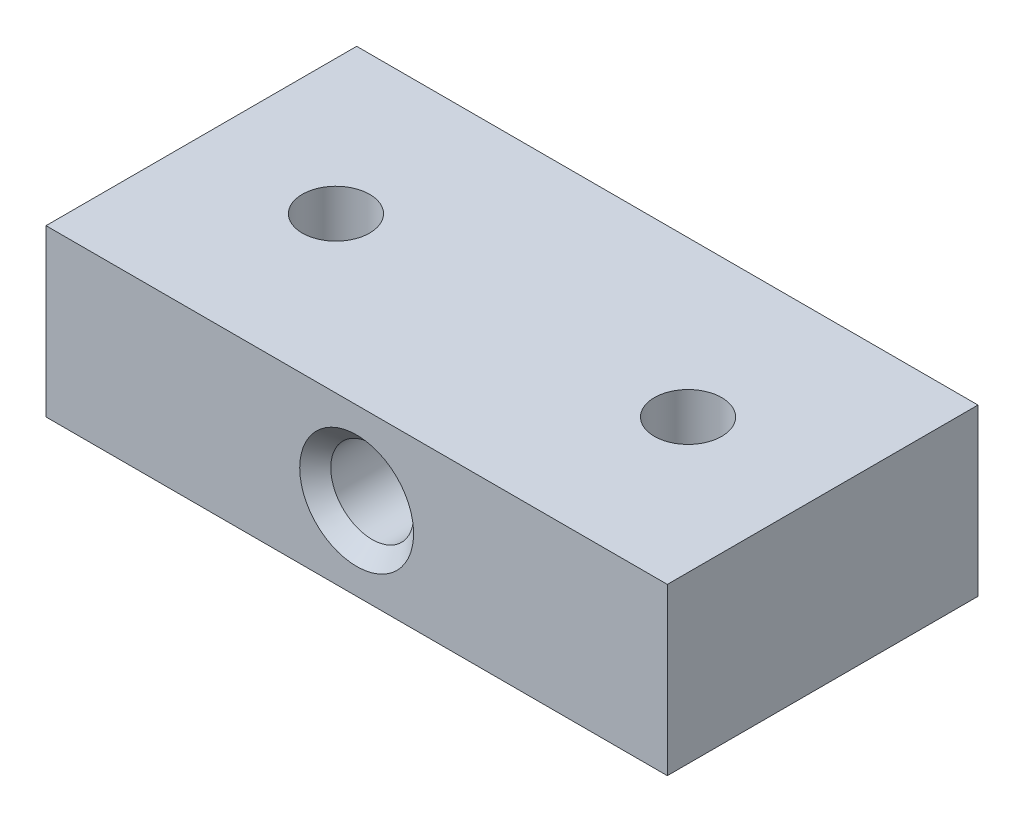
ISO-10303-21;
HEADER;
FILE_DESCRIPTION(('STEP AP214'),'2;1');
FILE_NAME('part.step','',(''),(''),'','','');
FILE_SCHEMA(('AUTOMOTIVE_DESIGN { 1 0 10303 214 1 1 1 1 }'));
ENDSEC;
DATA;
#1=APPLICATION_CONTEXT('core data for automotive mechanical design processes');
#2=APPLICATION_PROTOCOL_DEFINITION('international standard','automotive_design',2000,#1);
#3=PRODUCT_CONTEXT('',#1,'mechanical');
#4=PRODUCT('Part','Part','',(#3));
#5=PRODUCT_RELATED_PRODUCT_CATEGORY('part','',(#4));
#6=PRODUCT_DEFINITION_FORMATION('','',#4);
#7=PRODUCT_DEFINITION_CONTEXT('part definition',#1,'design');
#8=PRODUCT_DEFINITION('design','',#6,#7);
#9=PRODUCT_DEFINITION_SHAPE('','',#8);
#10=(LENGTH_UNIT() NAMED_UNIT(*) SI_UNIT(.MILLI.,.METRE.));
#11=(NAMED_UNIT(*) PLANE_ANGLE_UNIT() SI_UNIT($,.RADIAN.));
#12=(NAMED_UNIT(*) SI_UNIT($,.STERADIAN.) SOLID_ANGLE_UNIT());
#13=UNCERTAINTY_MEASURE_WITH_UNIT(LENGTH_MEASURE(1.E-05),#10,'distance_accuracy_value','');
#14=(GEOMETRIC_REPRESENTATION_CONTEXT(3) GLOBAL_UNCERTAINTY_ASSIGNED_CONTEXT((#13)) GLOBAL_UNIT_ASSIGNED_CONTEXT((#10,
#11,#12)) REPRESENTATION_CONTEXT('',''));
#15=CARTESIAN_POINT('',(0.,0.,0.));
#16=DIRECTION('',(0.,0.,1.));
#17=DIRECTION('',(1.,0.,0.));
#18=AXIS2_PLACEMENT_3D('',#15,#16,#17);
#19=CARTESIAN_POINT('',(0.,16.,0.));
#20=DIRECTION('',(0.,-1.,0.));
#21=DIRECTION('',(0.,0.,-1.));
#22=AXIS2_PLACEMENT_3D('',#19,#20,#21);
#23=PLANE('',#22);
#24=CARTESIAN_POINT('',(13.,16.,-15.));
#25=DIRECTION('',(0.,1.,0.));
#26=DIRECTION('',(0.,0.,1.));
#27=AXIS2_PLACEMENT_3D('',#24,#25,#26);
#28=CIRCLE('',#27,3.25);
#29=CARTESIAN_POINT('',(13.,16.,-11.75));
#30=VERTEX_POINT('',#29);
#31=EDGE_CURVE('E106',#30,#30,#28,.T.);
#32=ORIENTED_EDGE('',*,*,#31,.F.);
#33=EDGE_LOOP('',(#32));
#34=FACE_BOUND('',#33,.T.);
#35=DIRECTION('',(0.,0.,1.));
#36=VECTOR('',#35,1.);
#37=CARTESIAN_POINT('',(0.,16.,0.));
#38=LINE('',#37,#36);
#39=CARTESIAN_POINT('',(0.,16.,-30.));
#40=VERTEX_POINT('',#39);
#41=CARTESIAN_POINT('',(0.,16.,0.));
#42=VERTEX_POINT('',#41);
#43=EDGE_CURVE('E88',#40,#42,#38,.T.);
#44=ORIENTED_EDGE('',*,*,#43,.T.);
#45=DIRECTION('',(1.,0.,0.));
#46=VECTOR('',#45,1.);
#47=CARTESIAN_POINT('',(0.,16.,0.));
#48=LINE('',#47,#46);
#49=CARTESIAN_POINT('',(60.,16.,0.));
#50=VERTEX_POINT('',#49);
#51=EDGE_CURVE('E83',#42,#50,#48,.T.);
#52=ORIENTED_EDGE('',*,*,#51,.T.);
#53=DIRECTION('',(0.,0.,-1.));
#54=VECTOR('',#53,1.);
#55=CARTESIAN_POINT('',(60.,16.,0.));
#56=LINE('',#55,#54);
#57=CARTESIAN_POINT('',(60.,16.,-30.));
#58=VERTEX_POINT('',#57);
#59=EDGE_CURVE('E86',#50,#58,#56,.T.);
#60=ORIENTED_EDGE('',*,*,#59,.T.);
#61=DIRECTION('',(-1.,0.,0.));
#62=VECTOR('',#61,1.);
#63=CARTESIAN_POINT('',(0.,16.,-30.));
#64=LINE('',#63,#62);
#65=EDGE_CURVE('E52',#58,#40,#64,.T.);
#66=ORIENTED_EDGE('',*,*,#65,.T.);
#67=EDGE_LOOP('',(#44,#52,#60,#66));
#68=FACE_BOUND('',#67,.T.);
#69=CARTESIAN_POINT('',(47.,16.,-15.));
#70=DIRECTION('',(0.,1.,0.));
#71=DIRECTION('',(0.,0.,1.));
#72=AXIS2_PLACEMENT_3D('',#69,#70,#71);
#73=CIRCLE('',#72,3.25);
#74=CARTESIAN_POINT('',(47.,16.,-11.75));
#75=VERTEX_POINT('',#74);
#76=EDGE_CURVE('E233',#75,#75,#73,.T.);
#77=ORIENTED_EDGE('',*,*,#76,.F.);
#78=EDGE_LOOP('',(#77));
#79=FACE_BOUND('',#78,.T.);
#80=ADVANCED_FACE('F35',(#34,#68,#79),#23,.F.);
#81=CARTESIAN_POINT('',(0.,0.,0.));
#82=DIRECTION('',(0.,-1.,0.));
#83=DIRECTION('',(0.,0.,-1.));
#84=AXIS2_PLACEMENT_3D('',#81,#82,#83);
#85=PLANE('',#84);
#86=CARTESIAN_POINT('',(13.,0.,-15.));
#87=DIRECTION('',(0.,1.,0.));
#88=DIRECTION('',(0.,0.,1.));
#89=AXIS2_PLACEMENT_3D('',#86,#87,#88);
#90=CIRCLE('',#89,3.25);
#91=CARTESIAN_POINT('',(13.,0.,-11.75));
#92=VERTEX_POINT('',#91);
#93=EDGE_CURVE('E236',#92,#92,#90,.T.);
#94=ORIENTED_EDGE('',*,*,#93,.T.);
#95=EDGE_LOOP('',(#94));
#96=FACE_BOUND('',#95,.T.);
#97=DIRECTION('',(0.,0.,1.));
#98=VECTOR('',#97,1.);
#99=CARTESIAN_POINT('',(0.,0.,0.));
#100=LINE('',#99,#98);
#101=CARTESIAN_POINT('',(0.,0.,-30.));
#102=VERTEX_POINT('',#101);
#103=CARTESIAN_POINT('',(0.,0.,0.));
#104=VERTEX_POINT('',#103);
#105=EDGE_CURVE('E103',#102,#104,#100,.T.);
#106=ORIENTED_EDGE('',*,*,#105,.F.);
#107=DIRECTION('',(-1.,0.,0.));
#108=VECTOR('',#107,1.);
#109=CARTESIAN_POINT('',(0.,0.,-30.));
#110=LINE('',#109,#108);
#111=CARTESIAN_POINT('',(60.,0.,-30.));
#112=VERTEX_POINT('',#111);
#113=EDGE_CURVE('E75',#112,#102,#110,.T.);
#114=ORIENTED_EDGE('',*,*,#113,.F.);
#115=DIRECTION('',(0.,0.,-1.));
#116=VECTOR('',#115,1.);
#117=CARTESIAN_POINT('',(60.,0.,0.));
#118=LINE('',#117,#116);
#119=CARTESIAN_POINT('',(60.,0.,0.));
#120=VERTEX_POINT('',#119);
#121=EDGE_CURVE('E69',#120,#112,#118,.T.);
#122=ORIENTED_EDGE('',*,*,#121,.F.);
#123=DIRECTION('',(1.,0.,0.));
#124=VECTOR('',#123,1.);
#125=CARTESIAN_POINT('',(0.,0.,0.));
#126=LINE('',#125,#124);
#127=EDGE_CURVE('E93',#104,#120,#126,.T.);
#128=ORIENTED_EDGE('',*,*,#127,.F.);
#129=EDGE_LOOP('',(#106,#114,#122,#128));
#130=FACE_BOUND('',#129,.T.);
#131=CARTESIAN_POINT('',(47.,0.,-15.));
#132=DIRECTION('',(0.,1.,0.));
#133=DIRECTION('',(0.,0.,1.));
#134=AXIS2_PLACEMENT_3D('',#131,#132,#133);
#135=CIRCLE('',#134,3.25);
#136=CARTESIAN_POINT('',(47.,0.,-11.75));
#137=VERTEX_POINT('',#136);
#138=EDGE_CURVE('E231',#137,#137,#135,.T.);
#139=ORIENTED_EDGE('',*,*,#138,.T.);
#140=EDGE_LOOP('',(#139));
#141=FACE_BOUND('',#140,.T.);
#142=ADVANCED_FACE('F143',(#96,#130,#141),#85,.T.);
#143=CARTESIAN_POINT('',(0.,16.,0.));
#144=DIRECTION('',(1.,0.,0.));
#145=DIRECTION('',(0.,0.,-1.));
#146=AXIS2_PLACEMENT_3D('',#143,#144,#145);
#147=PLANE('',#146);
#148=ORIENTED_EDGE('',*,*,#105,.T.);
#149=DIRECTION('',(0.,-1.,0.));
#150=VECTOR('',#149,1.);
#151=CARTESIAN_POINT('',(0.,16.,0.));
#152=LINE('',#151,#150);
#153=EDGE_CURVE('E94',#42,#104,#152,.T.);
#154=ORIENTED_EDGE('',*,*,#153,.F.);
#155=ORIENTED_EDGE('',*,*,#43,.F.);
#156=DIRECTION('',(0.,-1.,0.));
#157=VECTOR('',#156,1.);
#158=CARTESIAN_POINT('',(0.,16.,-30.));
#159=LINE('',#158,#157);
#160=EDGE_CURVE('E99',#40,#102,#159,.T.);
#161=ORIENTED_EDGE('',*,*,#160,.T.);
#162=EDGE_LOOP('',(#148,#154,#155,#161));
#163=FACE_BOUND('',#162,.T.);
#164=ADVANCED_FACE('F149',(#163),#147,.F.);
#165=CARTESIAN_POINT('',(0.,16.,0.));
#166=DIRECTION('',(0.,0.,-1.));
#167=DIRECTION('',(-1.,0.,0.));
#168=AXIS2_PLACEMENT_3D('',#165,#166,#167);
#169=PLANE('',#168);
#170=CARTESIAN_POINT('',(30.,8.,0.));
#171=DIRECTION('',(0.,0.,-1.));
#172=DIRECTION('',(-1.,0.,0.));
#173=AXIS2_PLACEMENT_3D('',#170,#171,#172);
#174=CIRCLE('',#173,5.50000000000003);
#175=CARTESIAN_POINT('',(24.5,8.,0.));
#176=VERTEX_POINT('',#175);
#177=EDGE_CURVE('E11',#176,#176,#174,.T.);
#178=ORIENTED_EDGE('',*,*,#177,.T.);
#179=EDGE_LOOP('',(#178));
#180=FACE_BOUND('',#179,.T.);
#181=ORIENTED_EDGE('',*,*,#127,.T.);
#182=DIRECTION('',(0.,-1.,0.));
#183=VECTOR('',#182,1.);
#184=CARTESIAN_POINT('',(60.,16.,0.));
#185=LINE('',#184,#183);
#186=EDGE_CURVE('E91',#50,#120,#185,.T.);
#187=ORIENTED_EDGE('',*,*,#186,.F.);
#188=ORIENTED_EDGE('',*,*,#51,.F.);
#189=ORIENTED_EDGE('',*,*,#153,.T.);
#190=EDGE_LOOP('',(#181,#187,#188,#189));
#191=FACE_BOUND('',#190,.T.);
#192=ADVANCED_FACE('F92',(#180,#191),#169,.F.);
#193=CARTESIAN_POINT('',(60.,16.,0.));
#194=DIRECTION('',(-1.,0.,0.));
#195=DIRECTION('',(0.,0.,1.));
#196=AXIS2_PLACEMENT_3D('',#193,#194,#195);
#197=PLANE('',#196);
#198=ORIENTED_EDGE('',*,*,#121,.T.);
#199=DIRECTION('',(0.,-1.,0.));
#200=VECTOR('',#199,1.);
#201=CARTESIAN_POINT('',(60.,16.,-30.));
#202=LINE('',#201,#200);
#203=EDGE_CURVE('E95',#58,#112,#202,.T.);
#204=ORIENTED_EDGE('',*,*,#203,.F.);
#205=ORIENTED_EDGE('',*,*,#59,.F.);
#206=ORIENTED_EDGE('',*,*,#186,.T.);
#207=EDGE_LOOP('',(#198,#204,#205,#206));
#208=FACE_BOUND('',#207,.T.);
#209=ADVANCED_FACE('F97',(#208),#197,.F.);
#210=CARTESIAN_POINT('',(0.,16.,-30.));
#211=DIRECTION('',(0.,0.,1.));
#212=DIRECTION('',(1.,0.,0.));
#213=AXIS2_PLACEMENT_3D('',#210,#211,#212);
#214=PLANE('',#213);
#215=CARTESIAN_POINT('',(30.,8.,-30.));
#216=DIRECTION('',(0.,0.,1.));
#217=DIRECTION('',(1.,0.,0.));
#218=AXIS2_PLACEMENT_3D('',#215,#216,#217);
#219=CIRCLE('',#218,5.50000000000002);
#220=CARTESIAN_POINT('',(35.5,8.,-30.));
#221=VERTEX_POINT('',#220);
#222=EDGE_CURVE('E113',#221,#221,#219,.T.);
#223=ORIENTED_EDGE('',*,*,#222,.T.);
#224=EDGE_LOOP('',(#223));
#225=FACE_BOUND('',#224,.T.);
#226=ORIENTED_EDGE('',*,*,#113,.T.);
#227=ORIENTED_EDGE('',*,*,#160,.F.);
#228=ORIENTED_EDGE('',*,*,#65,.F.);
#229=ORIENTED_EDGE('',*,*,#203,.T.);
#230=EDGE_LOOP('',(#226,#227,#228,#229));
#231=FACE_BOUND('',#230,.T.);
#232=ADVANCED_FACE('F129',(#225,#231),#214,.F.);
#233=CARTESIAN_POINT('',(13.,16.,-15.));
#234=DIRECTION('',(0.,-1.,0.));
#235=DIRECTION('',(0.,0.,-1.));
#236=AXIS2_PLACEMENT_3D('',#233,#234,#235);
#237=CYLINDRICAL_SURFACE('',#236,3.25);
#238=ORIENTED_EDGE('',*,*,#31,.T.);
#239=EDGE_LOOP('',(#238));
#240=FACE_BOUND('',#239,.T.);
#241=ORIENTED_EDGE('',*,*,#93,.F.);
#242=EDGE_LOOP('',(#241));
#243=FACE_BOUND('',#242,.T.);
#244=ADVANCED_FACE('F131',(#240,#243),#237,.F.);
#245=CARTESIAN_POINT('',(47.,16.,-15.));
#246=DIRECTION('',(0.,-1.,0.));
#247=DIRECTION('',(0.,0.,-1.));
#248=AXIS2_PLACEMENT_3D('',#245,#246,#247);
#249=CYLINDRICAL_SURFACE('',#248,3.25);
#250=ORIENTED_EDGE('',*,*,#76,.T.);
#251=EDGE_LOOP('',(#250));
#252=FACE_BOUND('',#251,.T.);
#253=ORIENTED_EDGE('',*,*,#138,.F.);
#254=EDGE_LOOP('',(#253));
#255=FACE_BOUND('',#254,.T.);
#256=ADVANCED_FACE('F137',(#252,#255),#249,.F.);
#257=CARTESIAN_POINT('',(30.,8.,-30.));
#258=DIRECTION('',(0.,0.,1.));
#259=DIRECTION('',(1.,0.,0.));
#260=AXIS2_PLACEMENT_3D('',#257,#258,#259);
#261=CYLINDRICAL_SURFACE('',#260,4.00000000000001);
#262=CARTESIAN_POINT('',(30.,8.,-28.5));
#263=DIRECTION('',(0.,0.,1.));
#264=DIRECTION('',(1.,0.,0.));
#265=AXIS2_PLACEMENT_3D('',#262,#263,#264);
#266=CIRCLE('',#265,4.00000000000001);
#267=CARTESIAN_POINT('',(34.,8.,-28.5));
#268=VERTEX_POINT('',#267);
#269=EDGE_CURVE('E44',#268,#268,#266,.F.);
#270=ORIENTED_EDGE('',*,*,#269,.T.);
#271=EDGE_LOOP('',(#270));
#272=FACE_BOUND('',#271,.T.);
#273=CARTESIAN_POINT('',(30.,8.,-1.50000000000001));
#274=DIRECTION('',(0.,0.,-1.));
#275=DIRECTION('',(-1.,0.,0.));
#276=AXIS2_PLACEMENT_3D('',#273,#274,#275);
#277=CIRCLE('',#276,4.00000000000001);
#278=CARTESIAN_POINT('',(26.,8.,-1.50000000000001));
#279=VERTEX_POINT('',#278);
#280=EDGE_CURVE('E116',#279,#279,#277,.F.);
#281=ORIENTED_EDGE('',*,*,#280,.T.);
#282=EDGE_LOOP('',(#281));
#283=FACE_BOUND('',#282,.T.);
#284=ADVANCED_FACE('F121',(#272,#283),#261,.F.);
#285=CARTESIAN_POINT('',(30.,8.,-30.));
#286=DIRECTION('',(0.,0.,-1.));
#287=DIRECTION('',(-1.,0.,0.));
#288=AXIS2_PLACEMENT_3D('',#285,#286,#287);
#289=CONICAL_SURFACE('',#288,5.50000000000002,0.785398163397446);
#290=ORIENTED_EDGE('',*,*,#269,.F.);
#291=EDGE_LOOP('',(#290));
#292=FACE_BOUND('',#291,.T.);
#293=ORIENTED_EDGE('',*,*,#222,.F.);
#294=EDGE_LOOP('',(#293));
#295=FACE_BOUND('',#294,.T.);
#296=ADVANCED_FACE('F124',(#292,#295),#289,.F.);
#297=CARTESIAN_POINT('',(30.,8.,-1.50000000000001));
#298=DIRECTION('',(0.,0.,1.));
#299=DIRECTION('',(1.,0.,0.));
#300=AXIS2_PLACEMENT_3D('',#297,#298,#299);
#301=CONICAL_SURFACE('',#300,4.00000000000001,0.785398163397451);
#302=ORIENTED_EDGE('',*,*,#177,.F.);
#303=EDGE_LOOP('',(#302));
#304=FACE_BOUND('',#303,.T.);
#305=ORIENTED_EDGE('',*,*,#280,.F.);
#306=EDGE_LOOP('',(#305));
#307=FACE_BOUND('',#306,.T.);
#308=ADVANCED_FACE('F37',(#304,#307),#301,.F.);
#309=CLOSED_SHELL('',(#80,#142,#164,#192,#209,#232,#244,#256,#284,#296,#308));
#310=MANIFOLD_SOLID_BREP('B2',#309);
#311=ADVANCED_BREP_SHAPE_REPRESENTATION('',(#18,#310),#14);
#312=SHAPE_DEFINITION_REPRESENTATION(#9,#311);
ENDSEC;
END-ISO-10303-21;
